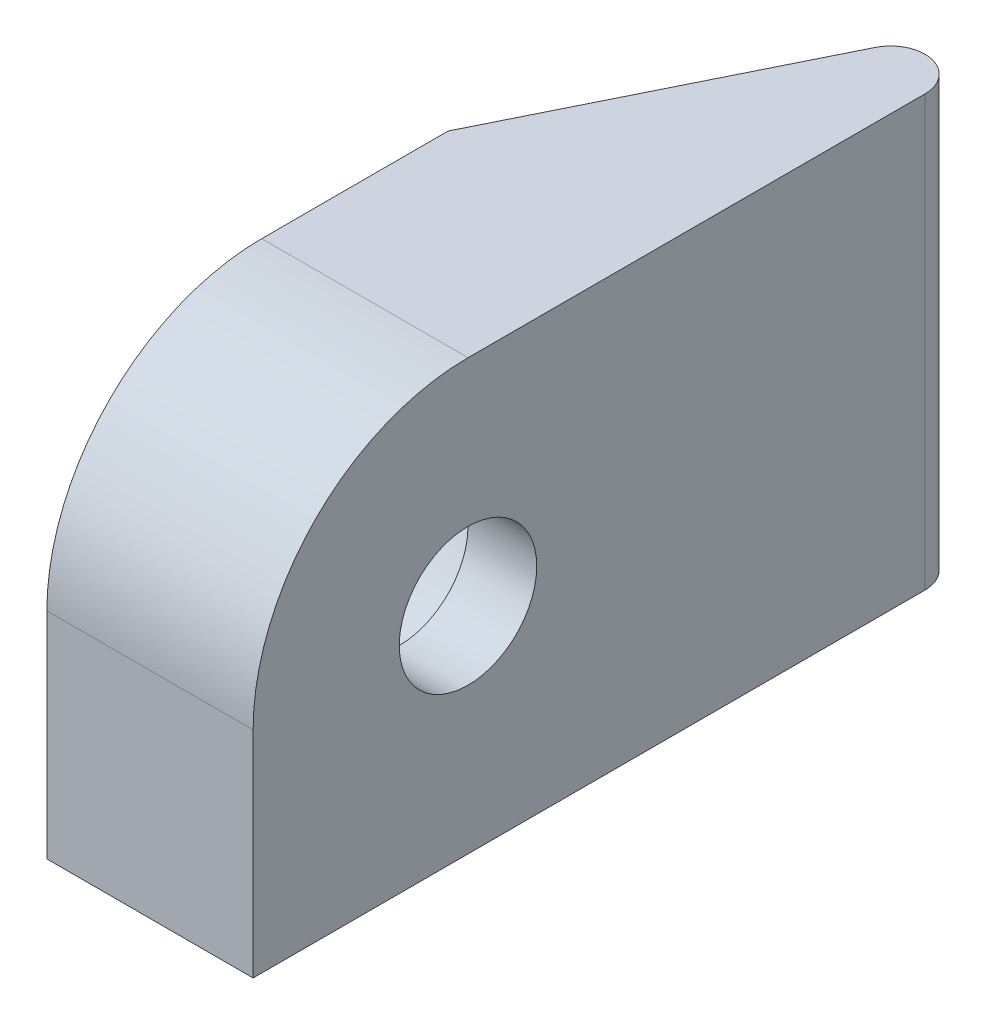
ISO-10303-21;
HEADER;
FILE_DESCRIPTION(('STEP AP214'),'2;1');
FILE_NAME('part.step','',(''),(''),'','','');
FILE_SCHEMA(('AUTOMOTIVE_DESIGN { 1 0 10303 214 1 1 1 1 }'));
ENDSEC;
DATA;
#1=APPLICATION_CONTEXT('core data for automotive mechanical design processes');
#2=APPLICATION_PROTOCOL_DEFINITION('international standard','automotive_design',2000,#1);
#3=PRODUCT_CONTEXT('',#1,'mechanical');
#4=PRODUCT('Part','Part','',(#3));
#5=PRODUCT_RELATED_PRODUCT_CATEGORY('part','',(#4));
#6=PRODUCT_DEFINITION_FORMATION('','',#4);
#7=PRODUCT_DEFINITION_CONTEXT('part definition',#1,'design');
#8=PRODUCT_DEFINITION('design','',#6,#7);
#9=PRODUCT_DEFINITION_SHAPE('','',#8);
#10=(LENGTH_UNIT() NAMED_UNIT(*) SI_UNIT(.MILLI.,.METRE.));
#11=(NAMED_UNIT(*) PLANE_ANGLE_UNIT() SI_UNIT($,.RADIAN.));
#12=(NAMED_UNIT(*) SI_UNIT($,.STERADIAN.) SOLID_ANGLE_UNIT());
#13=UNCERTAINTY_MEASURE_WITH_UNIT(LENGTH_MEASURE(1.E-05),#10,'distance_accuracy_value','');
#14=(GEOMETRIC_REPRESENTATION_CONTEXT(3) GLOBAL_UNCERTAINTY_ASSIGNED_CONTEXT((#13)) GLOBAL_UNIT_ASSIGNED_CONTEXT((#10,
#11,#12)) REPRESENTATION_CONTEXT('',''));
#15=CARTESIAN_POINT('',(0.,0.,0.));
#16=DIRECTION('',(0.,0.,1.));
#17=DIRECTION('',(1.,0.,0.));
#18=AXIS2_PLACEMENT_3D('',#15,#16,#17);
#19=CARTESIAN_POINT('',(0.,0.,0.));
#20=DIRECTION('',(-1.,0.,0.));
#21=DIRECTION('',(0.,0.,-1.));
#22=AXIS2_PLACEMENT_3D('',#19,#20,#21);
#23=PLANE('',#22);
#24=DIRECTION('',(0.,0.,1.));
#25=VECTOR('',#24,1.);
#26=CARTESIAN_POINT('',(0.,12.5,-42.));
#27=LINE('',#26,#25);
#28=CARTESIAN_POINT('',(0.,12.5,-26.5873371241312));
#29=VERTEX_POINT('',#28);
#30=CARTESIAN_POINT('',(0.,12.5,0.));
#31=VERTEX_POINT('',#30);
#32=EDGE_CURVE('E121',#29,#31,#27,.T.);
#33=ORIENTED_EDGE('',*,*,#32,.T.);
#34=CARTESIAN_POINT('',(0.,0.,0.));
#35=DIRECTION('',(1.,0.,0.));
#36=DIRECTION('',(0.,0.,-1.));
#37=AXIS2_PLACEMENT_3D('',#34,#35,#36);
#38=CIRCLE('',#37,12.5);
#39=CARTESIAN_POINT('',(0.,0.,12.5));
#40=VERTEX_POINT('',#39);
#41=EDGE_CURVE('E142',#31,#40,#38,.T.);
#42=ORIENTED_EDGE('',*,*,#41,.T.);
#43=DIRECTION('',(0.,-1.,0.));
#44=VECTOR('',#43,1.);
#45=CARTESIAN_POINT('',(0.,0.,12.5));
#46=LINE('',#45,#44);
#47=CARTESIAN_POINT('',(0.,-12.5,12.5));
#48=VERTEX_POINT('',#47);
#49=EDGE_CURVE('E164',#40,#48,#46,.T.);
#50=ORIENTED_EDGE('',*,*,#49,.T.);
#51=DIRECTION('',(0.,0.,-1.));
#52=VECTOR('',#51,1.);
#53=CARTESIAN_POINT('',(0.,-12.5,0.));
#54=LINE('',#53,#52);
#55=CARTESIAN_POINT('',(0.,-12.5,-26.5873371241312));
#56=VERTEX_POINT('',#55);
#57=EDGE_CURVE('E150',#48,#56,#54,.T.);
#58=ORIENTED_EDGE('',*,*,#57,.T.);
#59=DIRECTION('',(0.,1.,0.));
#60=VECTOR('',#59,1.);
#61=CARTESIAN_POINT('',(0.,0.,-26.5873371241312));
#62=LINE('',#61,#60);
#63=EDGE_CURVE('E56',#29,#56,#62,.F.);
#64=ORIENTED_EDGE('',*,*,#63,.F.);
#65=EDGE_LOOP('',(#33,#42,#50,#58,#64));
#66=FACE_BOUND('',#65,.T.);
#67=CARTESIAN_POINT('',(0.,0.,0.));
#68=DIRECTION('',(1.,0.,0.));
#69=DIRECTION('',(0.,0.,-1.));
#70=AXIS2_PLACEMENT_3D('',#67,#68,#69);
#71=CIRCLE('',#70,4.);
#72=CARTESIAN_POINT('',(0.,0.,-4.));
#73=VERTEX_POINT('',#72);
#74=EDGE_CURVE('E136',#73,#73,#71,.T.);
#75=ORIENTED_EDGE('',*,*,#74,.F.);
#76=EDGE_LOOP('',(#75));
#77=FACE_BOUND('',#76,.T.);
#78=ADVANCED_FACE('F47',(#66,#77),#23,.F.);
#79=CARTESIAN_POINT('',(-12.,0.,0.));
#80=DIRECTION('',(-1.,0.,0.));
#81=DIRECTION('',(0.,0.,-1.));
#82=AXIS2_PLACEMENT_3D('',#79,#80,#81);
#83=PLANE('',#82);
#84=DIRECTION('',(0.,1.,0.));
#85=VECTOR('',#84,1.);
#86=CARTESIAN_POINT('',(-12.,-12.501,-10.8475198655951));
#87=LINE('',#86,#85);
#88=CARTESIAN_POINT('',(-12.,-12.5,-10.8475198655951));
#89=VERTEX_POINT('',#88);
#90=CARTESIAN_POINT('',(-12.,12.5,-10.8475198655951));
#91=VERTEX_POINT('',#90);
#92=EDGE_CURVE('E110',#89,#91,#87,.T.);
#93=ORIENTED_EDGE('',*,*,#92,.F.);
#94=DIRECTION('',(0.,0.,-1.));
#95=VECTOR('',#94,1.);
#96=CARTESIAN_POINT('',(-12.,-12.5,0.));
#97=LINE('',#96,#95);
#98=CARTESIAN_POINT('',(-12.,-12.5,12.5));
#99=VERTEX_POINT('',#98);
#100=EDGE_CURVE('E157',#99,#89,#97,.T.);
#101=ORIENTED_EDGE('',*,*,#100,.F.);
#102=DIRECTION('',(0.,-1.,0.));
#103=VECTOR('',#102,1.);
#104=CARTESIAN_POINT('',(-12.,0.,12.5));
#105=LINE('',#104,#103);
#106=CARTESIAN_POINT('',(-12.,0.,12.5));
#107=VERTEX_POINT('',#106);
#108=EDGE_CURVE('E153',#107,#99,#105,.T.);
#109=ORIENTED_EDGE('',*,*,#108,.F.);
#110=CARTESIAN_POINT('',(-12.,0.,0.));
#111=DIRECTION('',(1.,0.,0.));
#112=DIRECTION('',(0.,0.,-1.));
#113=AXIS2_PLACEMENT_3D('',#110,#111,#112);
#114=CIRCLE('',#113,12.5);
#115=CARTESIAN_POINT('',(-12.,12.5,0.));
#116=VERTEX_POINT('',#115);
#117=EDGE_CURVE('E119',#116,#107,#114,.T.);
#118=ORIENTED_EDGE('',*,*,#117,.F.);
#119=DIRECTION('',(0.,0.,1.));
#120=VECTOR('',#119,1.);
#121=CARTESIAN_POINT('',(-12.,12.5,-42.));
#122=LINE('',#121,#120);
#123=EDGE_CURVE('E104',#91,#116,#122,.T.);
#124=ORIENTED_EDGE('',*,*,#123,.F.);
#125=EDGE_LOOP('',(#93,#101,#109,#118,#124));
#126=FACE_BOUND('',#125,.T.);
#127=CARTESIAN_POINT('',(-12.,0.,0.));
#128=DIRECTION('',(1.,0.,0.));
#129=DIRECTION('',(0.,0.,-1.));
#130=AXIS2_PLACEMENT_3D('',#127,#128,#129);
#131=CIRCLE('',#130,7.5);
#132=CARTESIAN_POINT('',(-12.,0.,-7.5));
#133=VERTEX_POINT('',#132);
#134=EDGE_CURVE('E146',#133,#133,#131,.T.);
#135=ORIENTED_EDGE('',*,*,#134,.T.);
#136=EDGE_LOOP('',(#135));
#137=FACE_BOUND('',#136,.T.);
#138=ADVANCED_FACE('F114',(#126,#137),#83,.T.);
#139=CARTESIAN_POINT('',(-12.,0.,0.));
#140=DIRECTION('',(1.,0.,0.));
#141=DIRECTION('',(0.,0.,1.));
#142=AXIS2_PLACEMENT_3D('',#139,#140,#141);
#143=CYLINDRICAL_SURFACE('',#142,12.5);
#144=DIRECTION('',(1.,0.,0.));
#145=VECTOR('',#144,1.);
#146=CARTESIAN_POINT('',(0.,12.5,0.));
#147=LINE('',#146,#145);
#148=EDGE_CURVE('E122',#116,#31,#147,.T.);
#149=ORIENTED_EDGE('',*,*,#148,.F.);
#150=ORIENTED_EDGE('',*,*,#117,.T.);
#151=DIRECTION('',(1.,0.,0.));
#152=VECTOR('',#151,1.);
#153=CARTESIAN_POINT('',(-12.,0.,12.5));
#154=LINE('',#153,#152);
#155=EDGE_CURVE('E173',#107,#40,#154,.T.);
#156=ORIENTED_EDGE('',*,*,#155,.T.);
#157=ORIENTED_EDGE('',*,*,#41,.F.);
#158=EDGE_LOOP('',(#149,#150,#156,#157));
#159=FACE_BOUND('',#158,.T.);
#160=ADVANCED_FACE('F193',(#159),#143,.T.);
#161=CARTESIAN_POINT('',(-12.,0.,0.));
#162=DIRECTION('',(1.,0.,0.));
#163=DIRECTION('',(0.,0.,1.));
#164=AXIS2_PLACEMENT_3D('',#161,#162,#163);
#165=CYLINDRICAL_SURFACE('',#164,7.5);
#166=ORIENTED_EDGE('',*,*,#134,.F.);
#167=EDGE_LOOP('',(#166));
#168=FACE_BOUND('',#167,.T.);
#169=CARTESIAN_POINT('',(-4.,0.,0.));
#170=DIRECTION('',(1.,0.,0.));
#171=DIRECTION('',(0.,0.,-1.));
#172=AXIS2_PLACEMENT_3D('',#169,#170,#171);
#173=CIRCLE('',#172,7.5);
#174=CARTESIAN_POINT('',(-4.,0.,-7.5));
#175=VERTEX_POINT('',#174);
#176=EDGE_CURVE('E176',#175,#175,#173,.T.);
#177=ORIENTED_EDGE('',*,*,#176,.T.);
#178=EDGE_LOOP('',(#177));
#179=FACE_BOUND('',#178,.T.);
#180=ADVANCED_FACE('F195',(#168,#179),#165,.F.);
#181=CARTESIAN_POINT('',(-4.,0.,0.));
#182=DIRECTION('',(1.,0.,0.));
#183=DIRECTION('',(0.,0.,1.));
#184=AXIS2_PLACEMENT_3D('',#181,#182,#183);
#185=CYLINDRICAL_SURFACE('',#184,4.);
#186=CARTESIAN_POINT('',(-4.,0.,0.));
#187=DIRECTION('',(1.,0.,0.));
#188=DIRECTION('',(0.,0.,-1.));
#189=AXIS2_PLACEMENT_3D('',#186,#187,#188);
#190=CIRCLE('',#189,4.);
#191=CARTESIAN_POINT('',(-4.,0.,-4.));
#192=VERTEX_POINT('',#191);
#193=EDGE_CURVE('E138',#192,#192,#190,.T.);
#194=ORIENTED_EDGE('',*,*,#193,.F.);
#195=EDGE_LOOP('',(#194));
#196=FACE_BOUND('',#195,.T.);
#197=ORIENTED_EDGE('',*,*,#74,.T.);
#198=EDGE_LOOP('',(#197));
#199=FACE_BOUND('',#198,.T.);
#200=ADVANCED_FACE('F201',(#196,#199),#185,.F.);
#201=CARTESIAN_POINT('',(-4.,0.,0.));
#202=DIRECTION('',(-1.,0.,0.));
#203=DIRECTION('',(0.,0.,-1.));
#204=AXIS2_PLACEMENT_3D('',#201,#202,#203);
#205=PLANE('',#204);
#206=ORIENTED_EDGE('',*,*,#176,.F.);
#207=EDGE_LOOP('',(#206));
#208=FACE_BOUND('',#207,.T.);
#209=ORIENTED_EDGE('',*,*,#193,.T.);
#210=EDGE_LOOP('',(#209));
#211=FACE_BOUND('',#210,.T.);
#212=ADVANCED_FACE('F213',(#208,#211),#205,.T.);
#213=CARTESIAN_POINT('',(-12.,0.,12.5));
#214=DIRECTION('',(0.,0.,-1.));
#215=DIRECTION('',(0.,1.,0.));
#216=AXIS2_PLACEMENT_3D('',#213,#214,#215);
#217=PLANE('',#216);
#218=ORIENTED_EDGE('',*,*,#49,.F.);
#219=ORIENTED_EDGE('',*,*,#155,.F.);
#220=ORIENTED_EDGE('',*,*,#108,.T.);
#221=DIRECTION('',(1.,0.,0.));
#222=VECTOR('',#221,1.);
#223=CARTESIAN_POINT('',(-12.,-12.5,12.5));
#224=LINE('',#223,#222);
#225=EDGE_CURVE('E160',#99,#48,#224,.T.);
#226=ORIENTED_EDGE('',*,*,#225,.T.);
#227=EDGE_LOOP('',(#218,#219,#220,#226));
#228=FACE_BOUND('',#227,.T.);
#229=ADVANCED_FACE('F190',(#228),#217,.F.);
#230=CARTESIAN_POINT('',(-12.,-12.5,0.));
#231=DIRECTION('',(0.,1.,0.));
#232=DIRECTION('',(0.,0.,1.));
#233=AXIS2_PLACEMENT_3D('',#230,#231,#232);
#234=PLANE('',#233);
#235=ORIENTED_EDGE('',*,*,#57,.F.);
#236=ORIENTED_EDGE('',*,*,#225,.F.);
#237=ORIENTED_EDGE('',*,*,#100,.T.);
#238=DIRECTION('',(0.442636197561957,0.,-0.896701286163844));
#239=VECTOR('',#238,1.);
#240=CARTESIAN_POINT('',(0.,-12.5,-35.1573605275983));
#241=LINE('',#240,#239);
#242=CARTESIAN_POINT('',(-3.79340257232769,-12.5,-27.4726095192551));
#243=VERTEX_POINT('',#242);
#244=EDGE_CURVE('E125',#89,#243,#241,.T.);
#245=ORIENTED_EDGE('',*,*,#244,.T.);
#246=CARTESIAN_POINT('',(-2.,-12.5,-26.5873371241312));
#247=DIRECTION('',(0.,-1.,0.));
#248=DIRECTION('',(0.,0.,1.));
#249=AXIS2_PLACEMENT_3D('',#246,#247,#248);
#250=CIRCLE('',#249,2.);
#251=EDGE_CURVE('E11',#56,#243,#250,.F.);
#252=ORIENTED_EDGE('',*,*,#251,.F.);
#253=EDGE_LOOP('',(#235,#236,#237,#245,#252));
#254=FACE_BOUND('',#253,.T.);
#255=ADVANCED_FACE('F188',(#254),#234,.F.);
#256=CARTESIAN_POINT('',(0.,12.5,-42.));
#257=DIRECTION('',(0.,1.,0.));
#258=DIRECTION('',(0.,0.,1.));
#259=AXIS2_PLACEMENT_3D('',#256,#257,#258);
#260=PLANE('',#259);
#261=DIRECTION('',(-0.442636197561957,0.,0.896701286163844));
#262=VECTOR('',#261,1.);
#263=CARTESIAN_POINT('',(0.,12.5,-35.1573605275983));
#264=LINE('',#263,#262);
#265=CARTESIAN_POINT('',(-3.79340257232769,12.5,-27.4726095192551));
#266=VERTEX_POINT('',#265);
#267=EDGE_CURVE('E101',#266,#91,#264,.T.);
#268=ORIENTED_EDGE('',*,*,#267,.T.);
#269=ORIENTED_EDGE('',*,*,#123,.T.);
#270=ORIENTED_EDGE('',*,*,#148,.T.);
#271=ORIENTED_EDGE('',*,*,#32,.F.);
#272=CARTESIAN_POINT('',(-2.,12.5,-26.5873371241312));
#273=DIRECTION('',(0.,-1.,0.));
#274=DIRECTION('',(0.,0.,1.));
#275=AXIS2_PLACEMENT_3D('',#272,#273,#274);
#276=CIRCLE('',#275,2.);
#277=EDGE_CURVE('E68',#266,#29,#276,.T.);
#278=ORIENTED_EDGE('',*,*,#277,.F.);
#279=EDGE_LOOP('',(#268,#269,#270,#271,#278));
#280=FACE_BOUND('',#279,.T.);
#281=ADVANCED_FACE('F103',(#280),#260,.T.);
#282=CARTESIAN_POINT('',(0.,-12.501,-35.1573605275983));
#283=DIRECTION('',(0.896701286163844,0.,0.442636197561957));
#284=DIRECTION('',(-0.442636197561957,0.,0.896701286163844));
#285=AXIS2_PLACEMENT_3D('',#282,#283,#284);
#286=PLANE('',#285);
#287=ORIENTED_EDGE('',*,*,#244,.F.);
#288=ORIENTED_EDGE('',*,*,#92,.T.);
#289=ORIENTED_EDGE('',*,*,#267,.F.);
#290=DIRECTION('',(0.,1.,0.));
#291=VECTOR('',#290,1.);
#292=CARTESIAN_POINT('',(-3.79340257232769,-12.501,-27.4726095192551));
#293=LINE('',#292,#291);
#294=EDGE_CURVE('E180',#243,#266,#293,.T.);
#295=ORIENTED_EDGE('',*,*,#294,.F.);
#296=EDGE_LOOP('',(#287,#288,#289,#295));
#297=FACE_BOUND('',#296,.T.);
#298=ADVANCED_FACE('F124',(#297),#286,.F.);
#299=CARTESIAN_POINT('',(-2.,-12.501,-26.5873371241312));
#300=DIRECTION('',(0.,1.,0.));
#301=DIRECTION('',(0.,0.,1.));
#302=AXIS2_PLACEMENT_3D('',#299,#300,#301);
#303=CYLINDRICAL_SURFACE('',#302,2.);
#304=ORIENTED_EDGE('',*,*,#251,.T.);
#305=ORIENTED_EDGE('',*,*,#294,.T.);
#306=ORIENTED_EDGE('',*,*,#277,.T.);
#307=ORIENTED_EDGE('',*,*,#63,.T.);
#308=EDGE_LOOP('',(#304,#305,#306,#307));
#309=FACE_BOUND('',#308,.T.);
#310=ADVANCED_FACE('F49',(#309),#303,.T.);
#311=CLOSED_SHELL('',(#78,#138,#160,#180,#200,#212,#229,#255,#281,#298,#310));
#312=MANIFOLD_SOLID_BREP('B2',#311);
#313=ADVANCED_BREP_SHAPE_REPRESENTATION('',(#18,#312),#14);
#314=SHAPE_DEFINITION_REPRESENTATION(#9,#313);
ENDSEC;
END-ISO-10303-21;
